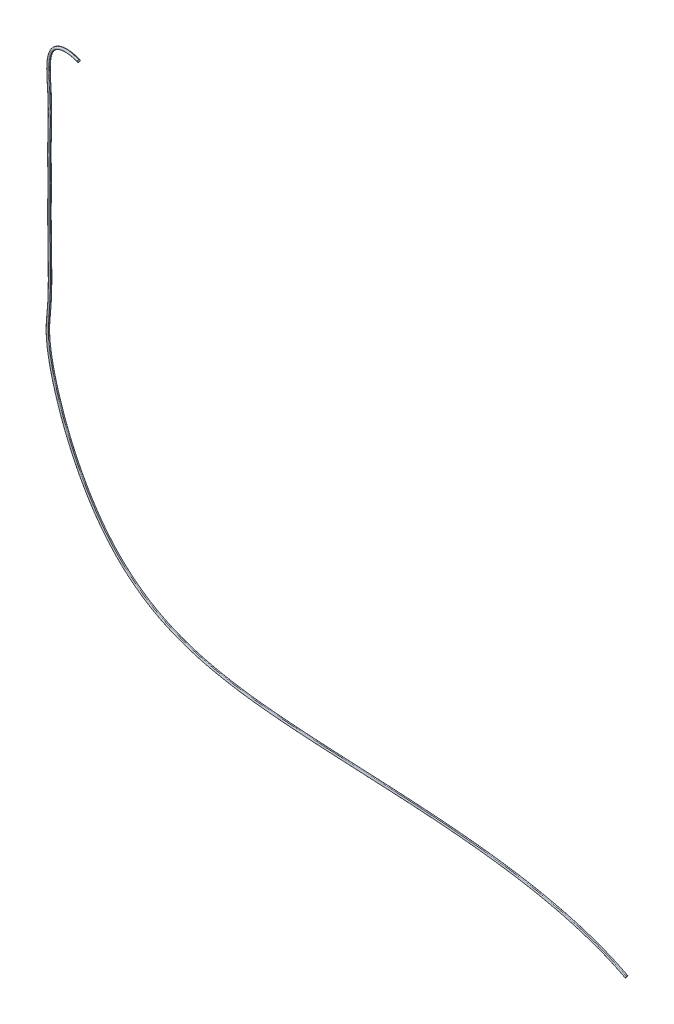
ISO-10303-21;
HEADER;
FILE_DESCRIPTION(('STEP AP214'),'2;1');
FILE_NAME('part.step','',(''),(''),'','','');
FILE_SCHEMA(('AUTOMOTIVE_DESIGN { 1 0 10303 214 1 1 1 1 }'));
ENDSEC;
DATA;
#1=APPLICATION_CONTEXT('core data for automotive mechanical design processes');
#2=APPLICATION_PROTOCOL_DEFINITION('international standard','automotive_design',2000,#1);
#3=PRODUCT_CONTEXT('',#1,'mechanical');
#4=PRODUCT('Part','Part','',(#3));
#5=PRODUCT_RELATED_PRODUCT_CATEGORY('part','',(#4));
#6=PRODUCT_DEFINITION_FORMATION('','',#4);
#7=PRODUCT_DEFINITION_CONTEXT('part definition',#1,'design');
#8=PRODUCT_DEFINITION('design','',#6,#7);
#9=PRODUCT_DEFINITION_SHAPE('','',#8);
#10=(LENGTH_UNIT() NAMED_UNIT(*) SI_UNIT(.MILLI.,.METRE.));
#11=(NAMED_UNIT(*) PLANE_ANGLE_UNIT() SI_UNIT($,.RADIAN.));
#12=(NAMED_UNIT(*) SI_UNIT($,.STERADIAN.) SOLID_ANGLE_UNIT());
#13=UNCERTAINTY_MEASURE_WITH_UNIT(LENGTH_MEASURE(1.E-05),#10,'distance_accuracy_value','');
#14=(GEOMETRIC_REPRESENTATION_CONTEXT(3) GLOBAL_UNCERTAINTY_ASSIGNED_CONTEXT((#13)) GLOBAL_UNIT_ASSIGNED_CONTEXT((#10,
#11,#12)) REPRESENTATION_CONTEXT('',''));
#15=CARTESIAN_POINT('',(0.,0.,0.));
#16=DIRECTION('',(0.,0.,1.));
#17=DIRECTION('',(1.,0.,0.));
#18=AXIS2_PLACEMENT_3D('',#15,#16,#17);
#19=CARTESIAN_POINT('',(-22.68005104515,2.224598771754,3.80305513116));
#20=CARTESIAN_POINT('',(-23.14939137977,2.27334218816,3.714687562907));
#21=CARTESIAN_POINT('',(-23.73612510197,2.258512520011,3.625875072399));
#22=CARTESIAN_POINT('',(-24.29269904815,2.036709590016,3.585241075448));
#23=CARTESIAN_POINT('',(-24.6934728354,1.642063572113,3.586840484367));
#24=CARTESIAN_POINT('',(-24.82623040238,0.803532674565,3.607831882713));
#25=CARTESIAN_POINT('',(-24.7092109809,-0.626143979658,3.592986233296));
#26=CARTESIAN_POINT('',(-24.69677301232,-2.074038040542,3.590939199145));
#27=CARTESIAN_POINT('',(-24.7399756797,-3.337813789141,3.59717232543));
#28=CARTESIAN_POINT('',(-24.72287696076,-4.47737515312,3.595492204974));
#29=CARTESIAN_POINT('',(-24.72614585388,-5.749508453577,3.59378715337));
#30=CARTESIAN_POINT('',(-24.73550897119,-7.40963613475,3.595086257423));
#31=CARTESIAN_POINT('',(-24.70248897414,-9.072153799069,3.595530145233));
#32=CARTESIAN_POINT('',(-24.69272537873,-10.29712343917,3.595347618964));
#33=CARTESIAN_POINT('',(-24.70610470099,-11.09383405472,3.595131911983));
#34=CARTESIAN_POINT('',(-24.74344853211,-11.73688838793,3.594989220726));
#35=CARTESIAN_POINT('',(-24.7985038808,-12.31832936208,3.594975186342));
#36=CARTESIAN_POINT('',(-24.84049991397,-12.91593660018,3.595083631492));
#37=CARTESIAN_POINT('',(-24.79327992147,-13.72085104324,3.595152291663));
#38=CARTESIAN_POINT('',(-24.60804254551,-14.77883854812,3.595126491561));
#39=CARTESIAN_POINT('',(-24.14560872555,-16.5244188663,3.595025938431));
#40=CARTESIAN_POINT('',(-23.12561137047,-19.20033795542,3.594965183938));
#41=CARTESIAN_POINT('',(-21.14840619477,-22.34174805652,3.595065556203));
#42=CARTESIAN_POINT('',(-18.40320213283,-24.60022804402,3.595129387952));
#43=CARTESIAN_POINT('',(-15.17321806605,-25.70784296162,3.595102209695));
#44=CARTESIAN_POINT('',(-11.71286656243,-26.20105784094,3.595060396968));
#45=CARTESIAN_POINT('',(-7.135053124169,-26.50445121977,3.595030081357));
#46=CARTESIAN_POINT('',(-2.848732678105,-26.66003490442,3.595044529593));
#47=CARTESIAN_POINT('',(1.703239265398,-27.05923259003,3.595071838688));
#48=CARTESIAN_POINT('',(5.866895686612,-27.66363313624,3.59509455135));
#49=CARTESIAN_POINT('',(8.646408634705,-28.61040465031,3.595086209381));
#50=CARTESIAN_POINT('',(9.939994491632,-29.28986294037,3.595070687589));
#51=CARTESIAN_POINT('',(-22.67594255195,2.224172083527,3.780998624961));
#52=CARTESIAN_POINT('',(-23.14567461272,2.272956182717,3.692557302365));
#53=CARTESIAN_POINT('',(-23.73316660904,2.258281920396,3.603592381906));
#54=CARTESIAN_POINT('',(-24.291385625,2.03582187288,3.562848018338));
#55=CARTESIAN_POINT('',(-24.69233038945,1.640697240673,3.564462760546));
#56=CARTESIAN_POINT('',(-24.8246999269,0.80365339853,3.585428717829));
#57=CARTESIAN_POINT('',(-24.70784867759,-0.625941703835,3.570597613238));
#58=CARTESIAN_POINT('',(-24.69529318949,-2.074193353165,3.56854500817));
#59=CARTESIAN_POINT('',(-24.73852941326,-3.337902049831,3.574781185237));
#60=CARTESIAN_POINT('',(-24.72140639733,-4.477297723891,3.573100291577));
#61=CARTESIAN_POINT('',(-24.72468246,-5.749557643154,3.571395751517));
#62=CARTESIAN_POINT('',(-24.73403697624,-7.409636241848,3.572694725487));
#63=CARTESIAN_POINT('',(-24.70101826542,-9.072129477646,3.573138754001));
#64=CARTESIAN_POINT('',(-24.69125370048,-10.2971167399,3.572956211347));
#65=CARTESIAN_POINT('',(-24.70463364163,-11.09386501431,3.572740514895));
#66=CARTESIAN_POINT('',(-24.74198153372,-11.73697844552,3.572597784721));
#67=CARTESIAN_POINT('',(-24.79704067648,-12.31845110978,3.572583794416));
#68=CARTESIAN_POINT('',(-24.83902826321,-12.91592568667,3.57269218505));
#69=CARTESIAN_POINT('',(-24.7918210379,-13.72066126996,3.572760862382));
#70=CARTESIAN_POINT('',(-24.60661079332,-14.77852224528,3.572735047095));
#71=CARTESIAN_POINT('',(-24.14421489243,-16.52396418945,3.572634520603));
#72=CARTESIAN_POINT('',(-23.12431021309,-19.19967989171,3.572573768421));
#73=CARTESIAN_POINT('',(-21.14728042566,-22.34078531488,3.572674129763));
#74=CARTESIAN_POINT('',(-18.40247804947,-24.59892731541,3.572737959055));
#75=CARTESIAN_POINT('',(-15.17287769196,-25.70642095738,3.572710779779));
#76=CARTESIAN_POINT('',(-11.71270442239,-26.19960211683,3.572668969337));
#77=CARTESIAN_POINT('',(-7.134973008623,-26.50298779752,3.572638649211));
#78=CARTESIAN_POINT('',(-2.848625550974,-26.65856939685,3.572653102518));
#79=CARTESIAN_POINT('',(1.703428674818,-27.05777409896,3.572680410383));
#80=CARTESIAN_POINT('',(5.867215471693,-27.66219101581,3.572703126822));
#81=CARTESIAN_POINT('',(8.646963645771,-28.60903025356,3.572694782415));
#82=CARTESIAN_POINT('',(9.940680097567,-29.28855713881,3.572679259056));
#83=CARTESIAN_POINT('',(-22.6699985227,2.201939898635,3.737165288818));
#84=CARTESIAN_POINT('',(-23.13894823257,2.250642746645,3.648871267533));
#85=CARTESIAN_POINT('',(-23.7252331616,2.235991145766,3.560139908746));
#86=CARTESIAN_POINT('',(-24.2772717445,2.014748377718,3.520010272037));
#87=CARTESIAN_POINT('',(-24.6681799924,1.630052222395,3.521567198009));
#88=CARTESIAN_POINT('',(-24.80008980574,0.806313520054,3.542253592045));
#89=CARTESIAN_POINT('',(-24.68351648105,-0.624422903858,3.527567022031));
#90=CARTESIAN_POINT('',(-24.67084005022,-2.074991048116,3.525441498605));
#91=CARTESIAN_POINT('',(-24.71414729517,-3.338305979496,3.53170730455));
#92=CARTESIAN_POINT('',(-24.69700503446,-4.476753881883,3.530013774323));
#93=CARTESIAN_POINT('',(-24.70029422686,-5.750063436829,3.528314410601));
#94=CARTESIAN_POINT('',(-24.70964521935,-7.409382250692,3.529609570917));
#95=CARTESIAN_POINT('',(-24.67663247779,-9.071676120304,3.530054581112));
#96=CARTESIAN_POINT('',(-24.66686235389,-10.29715089553,3.52987143712));
#97=CARTESIAN_POINT('',(-24.68024806953,-11.09468905899,3.529655763927));
#98=CARTESIAN_POINT('',(-24.71766353871,-11.7389272773,3.52951215362));
#99=CARTESIAN_POINT('',(-24.7727773093,-12.32101261361,3.529498955936));
#100=CARTESIAN_POINT('',(-24.81456025945,-12.91603045419,3.529606135918));
#101=CARTESIAN_POINT('',(-24.76758114632,-13.71742488974,3.529675157334));
#102=CARTESIAN_POINT('',(-24.58280581055,-14.77309339204,3.529648975166));
#103=CARTESIAN_POINT('',(-24.12104133475,-16.51609597402,3.529548951429));
#104=CARTESIAN_POINT('',(-23.10225080719,-19.18907488663,3.529488143628));
#105=CARTESIAN_POINT('',(-21.12812278978,-22.32487744572,3.529588275866));
#106=CARTESIAN_POINT('',(-18.39067098875,-24.57687196796,3.529652051259));
#107=CARTESIAN_POINT('',(-15.16787163455,-25.68240495317,3.529624846779));
#108=CARTESIAN_POINT('',(-11.7105026503,-26.17528874164,3.529583074806));
#109=CARTESIAN_POINT('',(-7.13417635016,-26.47859673702,3.529552665212));
#110=CARTESIAN_POINT('',(-2.847358940974,-26.63420052488,3.529567215223));
#111=CARTESIAN_POINT('',(1.706198477167,-27.0335280981,3.529594498477));
#112=CARTESIAN_POINT('',(5.872393207579,-27.63825493577,3.529617287855));
#113=CARTESIAN_POINT('',(8.655733723082,-28.58609403024,3.529608898412));
#114=CARTESIAN_POINT('',(9.952018342616,-29.26696985019,3.529593344237));
#115=CARTESIAN_POINT('',(-22.67443347108,2.12944711624,3.720733403807));
#116=CARTESIAN_POINT('',(-23.13854672187,2.177647673009,3.63334999279));
#117=CARTESIAN_POINT('',(-23.71561860722,2.16273436812,3.546334314049));
#118=CARTESIAN_POINT('',(-24.23773425398,1.949398995875,3.50886604484));
#119=CARTESIAN_POINT('',(-24.59442317545,1.601959815904,3.510163324771));
#120=CARTESIAN_POINT('',(-24.72693116694,0.81337715019,3.530086142065));
#121=CARTESIAN_POINT('',(-24.60992620653,-0.621106165608,3.515804284358));
#122=CARTESIAN_POINT('',(-24.59736073819,-2.076980332545,3.513478804432));
#123=CARTESIAN_POINT('',(-24.64063557393,-3.339300269827,3.519826992666));
#124=CARTESIAN_POINT('',(-24.6234998758,-4.475508476982,3.518099364784));
#125=CARTESIAN_POINT('',(-24.62678532656,-5.751506562915,3.516414344604));
#126=CARTESIAN_POINT('',(-24.63613942313,-7.408555588082,3.517699366022));
#127=CARTESIAN_POINT('',(-24.60313772719,-9.070302526412,3.51814724422));
#128=CARTESIAN_POINT('',(-24.59335230182,-10.2972616579,3.5179624624));
#129=CARTESIAN_POINT('',(-24.60675752003,-11.09715409832,3.517746856364));
#130=CARTESIAN_POINT('',(-24.64437265555,-11.74472717583,3.51760066613));
#131=CARTESIAN_POINT('',(-24.69965335894,-12.32858859294,3.517589839202));
#132=CARTESIAN_POINT('',(-24.7408290402,-12.91625287341,3.517693439972));
#133=CARTESIAN_POINT('',(-24.69453731794,-13.70768862179,3.517763487791));
#134=CARTESIAN_POINT('',(-24.51106995925,-14.75678004227,3.517736225124));
#135=CARTESIAN_POINT('',(-24.05121157809,-16.4924613854,3.517637704075));
#136=CARTESIAN_POINT('',(-23.03587357618,-19.15704450383,3.51757675077));
#137=CARTESIAN_POINT('',(-21.07049466063,-22.27691693934,3.517676203187));
#138=CARTESIAN_POINT('',(-18.35504369314,-24.51050592682,3.517739819317));
#139=CARTESIAN_POINT('',(-15.15264298071,-25.61011888648,3.51771254072));
#140=CARTESIAN_POINT('',(-11.70375945686,-26.10204960689,3.517670884686));
#141=CARTESIAN_POINT('',(-7.131659771669,-26.4051118228,3.517640208634));
#142=CARTESIAN_POINT('',(-2.843432065854,-26.56077089767,3.517655047392));
#143=CARTESIAN_POINT('',(1.714625563902,-26.96046710104,3.517682257394));
#144=CARTESIAN_POINT('',(5.888024657465,-27.56612016473,3.517705264371));
#145=CARTESIAN_POINT('',(8.682260287348,-28.51699943829,3.517696740203));
#146=CARTESIAN_POINT('',(9.986198666462,-29.20189540919,3.517681094191));
#147=CARTESIAN_POINT('',(-22.68898086826,2.072256436172,3.766451660007));
#148=CARTESIAN_POINT('',(-23.14820592418,2.119949328673,3.67998860009));
#149=CARTESIAN_POINT('',(-23.71563570317,2.104598724575,3.594766719266));
#150=CARTESIAN_POINT('',(-24.20953642369,1.899334211459,3.559710833983));
#151=CARTESIAN_POINT('',(-24.53844288068,1.582894735775,3.560767686982));
#152=CARTESIAN_POINT('',(-24.67240962689,0.818370461045,3.580152831552));
#153=CARTESIAN_POINT('',(-24.55448961015,-0.619161678305,3.566159861865));
#154=CARTESIAN_POINT('',(-24.54226605411,-2.078236674426,3.563692688369));
#155=CARTESIAN_POINT('',(-24.58540191145,-3.339914132611,3.570099385356));
#156=CARTESIAN_POINT('',(-24.56831191587,-4.474752044351,3.568347755364));
#157=CARTESIAN_POINT('',(-24.57157347533,-5.752545954571,3.566672910858));
#158=CARTESIAN_POINT('',(-24.58094084664,-7.407900049663,3.567950815604));
#159=CARTESIAN_POINT('',(-24.54794387334,-9.069265927427,3.56840077571));
#160=CARTESIAN_POINT('',(-24.53814785482,-10.29735509007,3.568214824171));
#161=CARTESIAN_POINT('',(-24.55156820471,-11.0990145691,3.567999263293));
#162=CARTESIAN_POINT('',(-24.58933181756,-11.74907976982,3.567851154563));
#163=CARTESIAN_POINT('',(-24.64473826227,-12.33425425741,3.567842106896));
#164=CARTESIAN_POINT('',(-24.68545793917,-12.91640106921,3.567943033847));
#165=CARTESIAN_POINT('',(-24.63968324218,-13.70037849529,3.568013851735));
#166=CARTESIAN_POINT('',(-24.45719639383,-14.74453671512,3.567985783144));
#167=CARTESIAN_POINT('',(-23.99877071363,-16.47472341125,3.567888389941));
#168=CARTESIAN_POINT('',(-22.98603788986,-19.13298083255,3.567827334076));
#169=CARTESIAN_POINT('',(-21.02723048938,-22.24089558779,3.567926278057));
#170=CARTESIAN_POINT('',(-18.32828255836,-24.46067809555,3.567989775504));
#171=CARTESIAN_POINT('',(-15.14118822294,-25.55584378229,3.567962441676));
#172=CARTESIAN_POINT('',(-11.69868166046,-26.04705172412,3.567920872961));
#173=CARTESIAN_POINT('',(-7.129755515721,-26.34992773319,3.567889997228));
#174=CARTESIAN_POINT('',(-2.84046972845,-26.50562706954,3.56790505258));
#175=CARTESIAN_POINT('',(1.720963812433,-26.90559984275,3.567932207704));
#176=CARTESIAN_POINT('',(5.899766998297,-27.51194765566,3.567955377833));
#177=CARTESIAN_POINT('',(8.702193630396,-28.46511341527,3.567946752627));
#178=CARTESIAN_POINT('',(10.011869565005,-29.15302304747,3.567931037769));
#179=CARTESIAN_POINT('',(-22.6980519238467,2.07331651479667,3.81521484547901));
#180=CARTESIAN_POINT('',(-23.15644184688,2.12092267443567,3.72890902468601));
#181=CARTESIAN_POINT('',(-23.7221107496033,2.10532468731033,3.64402418804934));
#182=CARTESIAN_POINT('',(-24.2125456866167,1.90148016893033,3.60919627243501));
#183=CARTESIAN_POINT('',(-24.54123944572,1.58590899814967,3.61022402288668));
#184=CARTESIAN_POINT('',(-24.67603613087,0.817897937045,3.62967121977668));
#185=CARTESIAN_POINT('',(-24.5576856214567,-0.619712166989667,3.61564602745501));
#186=CARTESIAN_POINT('',(-24.5456921234167,-2.07792651041733,3.61319358571501));
#187=CARTESIAN_POINT('',(-24.5887421871233,-3.33974305247367,3.61959349790334));
#188=CARTESIAN_POINT('',(-24.57169396923,-4.474946057065,3.61784427020068));
#189=CARTESIAN_POINT('',(-24.5749388308633,-5.75243968361367,3.61616825918801));
#190=CARTESIAN_POINT('',(-24.5843193175867,-7.40790622526433,3.61744678456601));
#191=CARTESIAN_POINT('',(-24.55131925616,-9.069323765175,3.61789649267001));
#192=CARTESIAN_POINT('',(-24.5415250299667,-10.2973624804167,3.61771062758434));
#193=CARTESIAN_POINT('',(-24.5549445838833,-11.0989207579933,3.61749505164101));
#194=CARTESIAN_POINT('',(-24.59269821758,-11.7488322321533,3.61734705879701));
#195=CARTESIAN_POINT('',(-24.6480968516033,-12.3339170941767,3.61733790308801));
#196=CARTESIAN_POINT('',(-24.6888415513633,-12.91639289471,3.61743898579234));
#197=CARTESIAN_POINT('',(-24.6430364912333,-13.70082259517,3.61750975879701));
#198=CARTESIAN_POINT('',(-24.46048788095,-14.7452821652667,3.61748173640601));
#199=CARTESIAN_POINT('',(-24.0019754992167,-16.47580059767,3.61738427614834));
#200=CARTESIAN_POINT('',(-22.9890721184133,-19.1344605835767,3.61732322446201));
#201=CARTESIAN_POINT('',(-21.0298631790533,-22.2430989249433,3.61742219827234));
#202=CARTESIAN_POINT('',(-18.3299248344133,-24.4637113667767,3.61748570270134));
#203=CARTESIAN_POINT('',(-15.1419060703,-25.55915043395,3.61745837203401));
#204=CARTESIAN_POINT('',(-11.6990055045267,-26.0504099494333,3.61741679803368));
#205=CARTESIAN_POINT('',(-7.12988692323767,-26.3532985700567,3.61738593410534));
#206=CARTESIAN_POINT('',(-2.84066551078533,-26.5089972129733,3.61740097657934));
#207=CARTESIAN_POINT('',(1.72056548783167,-26.9089531959433,3.61742813494201));
#208=CARTESIAN_POINT('',(5.899045284485,-27.5152597273333,3.61745129538768));
#209=CARTESIAN_POINT('',(8.70096267152267,-28.4682822023967,3.61744267623234));
#210=CARTESIAN_POINT('',(10.010299346063,-29.1560136376433,3.61742696544501));
#211=CARTESIAN_POINT('',(-22.7007437047067,2.08336592886184,3.83505474985952));
#212=CARTESIAN_POINT('',(-23.1594797642067,2.13100803655934,3.74868375836752));
#213=CARTESIAN_POINT('',(-23.72572612332,2.11536794175334,3.66369254785819));
#214=CARTESIAN_POINT('',(-24.21891429989,1.91097952200251,3.62859065727868));
#215=CARTESIAN_POINT('',(-24.55210727917,1.590737744376,3.62964315424102));
#216=CARTESIAN_POINT('',(-24.6871203828533,0.816761192957832,3.64921519061918));
#217=CARTESIAN_POINT('',(-24.5686637211817,-0.620365509741167,3.63512454841002));
#218=CARTESIAN_POINT('',(-24.55673449405,-2.07755368605583,3.63270439233852));
#219=CARTESIAN_POINT('',(-24.5997562780167,-3.33955183604917,3.63909089619885));
#220=CARTESIAN_POINT('',(-24.5827206406783,-4.475184821034,3.63734717907918));
#221=CARTESIAN_POINT('',(-24.58595984249,-5.7522094526915,3.63566883441035));
#222=CARTESIAN_POINT('',(-24.5953438298133,-7.40801933835917,3.63694898481885));
#223=CARTESIAN_POINT('',(-24.5623411197933,-9.06952808723883,3.63739823016752));
#224=CARTESIAN_POINT('',(-24.5525495199133,-10.2973495068933,3.63721262205468));
#225=CARTESIAN_POINT('',(-24.56596625464,-11.09855552333,3.63699703308502));
#226=CARTESIAN_POINT('',(-24.60368956637,-11.7479645530817,3.63684942982135));
#227=CARTESIAN_POINT('',(-24.65906321561,-12.3327781382117,3.63683991830485));
#228=CARTESIAN_POINT('',(-24.699898590945,-12.9163564029983,3.63694153871285));
#229=CARTESIAN_POINT('',(-24.6539907616567,-13.7022826033383,3.63701215797402));
#230=CARTESIAN_POINT('',(-24.471245435585,-14.7477295407317,3.63698429794402));
#231=CARTESIAN_POINT('',(-24.0124475459067,-16.4793459282917,3.63688661243152));
#232=CARTESIAN_POINT('',(-22.9990269356117,-19.1392637067667,3.63682558313335));
#233=CARTESIAN_POINT('',(-21.0385061331,-22.2502909539017,3.63692465901835));
#234=CARTESIAN_POINT('',(-18.3352676880983,-24.473664344625,3.63698818741452));
#235=CARTESIAN_POINT('',(-15.1441892127067,-25.56999118922,3.63696086788985));
#236=CARTESIAN_POINT('',(-11.700016294315,-26.0613934688817,3.63691927653535));
#237=CARTESIAN_POINT('',(-7.1302639829865,-26.36431884133,3.63688845258035));
#238=CARTESIAN_POINT('',(-2.84125420285783,-26.5200092273567,3.63690345175452));
#239=CARTESIAN_POINT('',(1.719301822364,-26.919909898635,3.63693062110735));
#240=CARTESIAN_POINT('',(5.89670111063467,-27.52607755229,3.63695374891568));
#241=CARTESIAN_POINT('',(8.6969849224545,-28.47864418169,3.63694514996935));
#242=CARTESIAN_POINT('',(10.0051736408587,-29.16577265092,3.63692945295652));
#243=B_SPLINE_SURFACE_WITH_KNOTS('',3,3,((#19,#20,#21,#22,#23,#24,#25,#26,#27,#28,#29,#30,#31,
#32,#33,#34,#35,#36,#37,#38,#39,#40,#41,#42,#43,#44,#45,#46,#47,#48,#49,#50),(#51,#52,#53,#54,
#55,#56,#57,#58,#59,#60,#61,#62,#63,#64,#65,#66,#67,#68,#69,#70,#71,#72,#73,#74,#75,#76,#77,#78,
#79,#80,#81,#82),(#83,#84,#85,#86,#87,#88,#89,#90,#91,#92,#93,#94,#95,#96,#97,#98,#99,#100,#101,
#102,#103,#104,#105,#106,#107,#108,#109,#110,#111,#112,#113,#114),(#115,#116,#117,#118,#119,
#120,#121,#122,#123,#124,#125,#126,#127,#128,#129,#130,#131,#132,#133,#134,#135,#136,#137,#138,
#139,#140,#141,#142,#143,#144,#145,#146),(#147,#148,#149,#150,#151,#152,#153,#154,#155,#156,
#157,#158,#159,#160,#161,#162,#163,#164,#165,#166,#167,#168,#169,#170,#171,#172,#173,#174,#175,
#176,#177,#178),(#179,#180,#181,#182,#183,#184,#185,#186,#187,#188,#189,#190,#191,#192,#193,
#194,#195,#196,#197,#198,#199,#200,#201,#202,#203,#204,#205,#206,#207,#208,#209,#210),(#211,
#212,#213,#214,#215,#216,#217,#218,#219,#220,#221,#222,#223,#224,#225,#226,#227,#228,#229,#230,
#231,#232,#233,#234,#235,#236,#237,#238,#239,#240,#241,#242)),.UNSPECIFIED.,.F.,.F.,.F.,(4,1,1,
1,4),(4,1,1,1,1,1,1,1,1,1,1,1,1,1,1,1,1,1,1,1,1,1,1,1,1,1,1,1,1,4),(-3.14159265359,
-2.243994752564,-1.346396851538,-0.448798950513,0.448798950513),(0.,0.03571428571429,
0.05357142857143,0.07142857142857,0.107142857143,0.142857142857,0.178571428571,0.214285714286,
0.25,0.285714285714,0.321428571429,0.357142857143,0.375,0.392857142857,0.410714285714,
0.428571428571,0.452380952381,0.47619047619,0.5,0.52380952381,0.571428571429,0.619047619048,
0.666666666667,0.714285714286,0.75,0.785714285714,0.857142857143,0.875,0.928571428571,1.),.UNSPECIFIED.);
#244=CARTESIAN_POINT('',(-22.68005104515,2.224598771754,3.80305513116));
#245=CARTESIAN_POINT('',(-23.14939137977,2.27334218816,3.714687562907));
#246=CARTESIAN_POINT('',(-23.73612510197,2.258512520011,3.625875072399));
#247=CARTESIAN_POINT('',(-24.29269904815,2.036709590016,3.585241075448));
#248=CARTESIAN_POINT('',(-24.6934728354,1.642063572113,3.586840484367));
#249=CARTESIAN_POINT('',(-24.82623040238,0.803532674565,3.607831882713));
#250=CARTESIAN_POINT('',(-24.7092109809,-0.626143979658,3.592986233296));
#251=CARTESIAN_POINT('',(-24.69677301232,-2.074038040542,3.590939199145));
#252=CARTESIAN_POINT('',(-24.7399756797,-3.337813789141,3.59717232543));
#253=CARTESIAN_POINT('',(-24.72287696076,-4.47737515312,3.595492204974));
#254=CARTESIAN_POINT('',(-24.72614585388,-5.749508453577,3.59378715337));
#255=CARTESIAN_POINT('',(-24.73550897119,-7.40963613475,3.595086257423));
#256=CARTESIAN_POINT('',(-24.70248897414,-9.072153799069,3.595530145233));
#257=CARTESIAN_POINT('',(-24.69272537873,-10.29712343917,3.595347618964));
#258=CARTESIAN_POINT('',(-24.70610470099,-11.09383405472,3.595131911983));
#259=CARTESIAN_POINT('',(-24.74344853211,-11.73688838793,3.594989220726));
#260=CARTESIAN_POINT('',(-24.7985038808,-12.31832936208,3.594975186342));
#261=CARTESIAN_POINT('',(-24.84049991397,-12.91593660018,3.595083631492));
#262=CARTESIAN_POINT('',(-24.79327992147,-13.72085104324,3.595152291663));
#263=CARTESIAN_POINT('',(-24.60804254551,-14.77883854812,3.595126491561));
#264=CARTESIAN_POINT('',(-24.14560872555,-16.5244188663,3.595025938431));
#265=CARTESIAN_POINT('',(-23.12561137047,-19.20033795542,3.594965183938));
#266=CARTESIAN_POINT('',(-21.14840619477,-22.34174805652,3.595065556203));
#267=CARTESIAN_POINT('',(-18.40320213283,-24.60022804402,3.595129387952));
#268=CARTESIAN_POINT('',(-15.17321806605,-25.70784296162,3.595102209695));
#269=CARTESIAN_POINT('',(-11.71286656243,-26.20105784094,3.595060396968));
#270=CARTESIAN_POINT('',(-7.135053124169,-26.50445121977,3.595030081357));
#271=CARTESIAN_POINT('',(-2.848732678105,-26.66003490442,3.595044529593));
#272=CARTESIAN_POINT('',(1.703239265398,-27.05923259003,3.595071838688));
#273=CARTESIAN_POINT('',(5.866895686612,-27.66363313624,3.59509455135));
#274=CARTESIAN_POINT('',(8.646408634705,-28.61040465031,3.595086209381));
#275=CARTESIAN_POINT('',(9.939994491632,-29.28986294037,3.595070687589));
#276=B_SPLINE_CURVE_WITH_KNOTS('',3,(#244,#245,#246,#247,#248,#249,#250,#251,#252,#253,#254,
#255,#256,#257,#258,#259,#260,#261,#262,#263,#264,#265,#266,#267,#268,#269,#270,#271,#272,#273,
#274,#275),.UNSPECIFIED.,.F.,.F.,(4,1,1,1,1,1,1,1,1,1,1,1,1,1,1,1,1,1,1,1,1,1,1,1,1,1,1,1,1,4),
(0.,0.03571428571429,0.05357142857143,0.07142857142857,0.107142857143,0.142857142857,
0.178571428571,0.214285714286,0.25,0.285714285714,0.321428571429,0.357142857143,0.375,
0.392857142857,0.410714285714,0.428571428571,0.452380952381,0.47619047619,0.5,0.52380952381,
0.571428571429,0.619047619048,0.666666666667,0.714285714286,0.75,0.785714285714,0.857142857143,
0.875,0.928571428571,1.),.UNSPECIFIED.);
#277=CARTESIAN_POINT('',(-22.680051045149,2.2245987717539,3.80305513116018));
#278=VERTEX_POINT('',#277);
#279=CARTESIAN_POINT('',(9.93999449163114,-29.2898629403695,3.595070687589));
#280=VERTEX_POINT('',#279);
#281=EDGE_CURVE('E11',#278,#280,#276,.T.);
#282=CARTESIAN_POINT('',(-22.6800510451515,2.22459877175415,3.80305513115972));
#283=CARTESIAN_POINT('',(-22.6785055019685,2.22443594500692,3.7947565833814));
#284=CARTESIAN_POINT('',(-22.6771135789404,2.22275381421484,3.78643590151985));
#285=CARTESIAN_POINT('',(-22.6747781511014,2.21680220480745,3.77074901219451));
#286=CARTESIAN_POINT('',(-22.6738338394324,2.21253741352294,3.76338110484752));
#287=CARTESIAN_POINT('',(-22.6728185194482,2.20444526363764,3.75352489104419));
#288=CARTESIAN_POINT('',(-22.6725459815913,2.20139948752892,3.75039733482308));
#289=CARTESIAN_POINT('',(-22.6721677966124,2.19478694017454,3.74474123696308));
#290=CARTESIAN_POINT('',(-22.6720620425471,2.19122050438523,3.74221231236089));
#291=CARTESIAN_POINT('',(-22.6719936448893,2.1804650672187,3.73591635391382));
#292=CARTESIAN_POINT('',(-22.6722319513619,2.17279576579025,3.7329516790369));
#293=CARTESIAN_POINT('',(-22.6732479024559,2.15646447646114,3.72933931292796));
#294=CARTESIAN_POINT('',(-22.6740568785611,2.14777056192816,3.72884041967413));
#295=CARTESIAN_POINT('',(-22.6756581581416,2.13507740956783,3.7303436576906));
#296=CARTESIAN_POINT('',(-22.676256478132,2.13090469453827,3.73121980855766));
#297=CARTESIAN_POINT('',(-22.6775658869128,2.12280121427738,3.73370451020736));
#298=CARTESIAN_POINT('',(-22.6782770432813,2.11887059600931,3.73531350097692));
#299=CARTESIAN_POINT('',(-22.6804528156686,2.10800319569899,3.74087508342513));
#300=CARTESIAN_POINT('',(-22.6820263787217,2.10149130986805,3.74564068983072));
#301=CARTESIAN_POINT('',(-22.6854495769856,2.08986494501741,3.75740899235891));
#302=CARTESIAN_POINT('',(-22.6873111337715,2.0848962294251,3.76455540957192));
#303=CARTESIAN_POINT('',(-22.6908754870559,2.07816731657393,3.7797748457165));
#304=CARTESIAN_POINT('',(-22.6925814748341,2.07625145239461,3.78777894862472));
#305=CARTESIAN_POINT('',(-22.6957703895075,2.07505295671572,3.80405491428478));
#306=CARTESIAN_POINT('',(-22.6972522083287,2.07578298756483,3.8123278763345));
#307=CARTESIAN_POINT('',(-22.6992141508817,2.07889548205739,3.82446504852983));
#308=CARTESIAN_POINT('',(-22.6998364542475,2.08033245243689,3.82856287451218));
#309=CARTESIAN_POINT('',(-22.700945004314,2.08394058249728,3.83644087612876));
#310=CARTESIAN_POINT('',(-22.7014313219981,2.08611135782567,3.84022121676406));
#311=CARTESIAN_POINT('',(-22.7026168304014,2.09324256705171,3.8504512867741));
#312=CARTESIAN_POINT('',(-22.7031363855628,2.098991987511,3.85638213448908));
#313=CARTESIAN_POINT('',(-22.7036583216266,2.11241470081493,3.86655820437992));
#314=CARTESIAN_POINT('',(-22.7036287481452,2.12018069448183,3.87068484315692));
#315=CARTESIAN_POINT('',(-22.7031001040872,2.13244445188053,3.87464176381569));
#316=CARTESIAN_POINT('',(-22.702846025995,2.13660889756283,3.87558939897365));
#317=CARTESIAN_POINT('',(-22.7021867662363,2.1450290147738,3.87673244370512));
#318=CARTESIAN_POINT('',(-22.701781477753,2.14928474878187,3.87692732041341));
#319=CARTESIAN_POINT('',(-22.7004254739421,2.16152395734154,3.87647640333336));
#320=CARTESIAN_POINT('',(-22.6993097601739,2.16946727194362,3.87493211300221));
#321=CARTESIAN_POINT('',(-22.6966206821946,2.18509330376483,3.86926910119654));
#322=CARTESIAN_POINT('',(-22.6950169730632,2.19269940236281,3.86494694820542));
#323=CARTESIAN_POINT('',(-22.6916545297874,2.20544264942282,3.85411739984613));
#324=CARTESIAN_POINT('',(-22.6899067956436,2.21068001364716,3.84772370685469));
#325=CARTESIAN_POINT('',(-22.6863911690453,2.21885159048065,3.83355884054116));
#326=CARTESIAN_POINT('',(-22.6846232187606,2.22177137297044,3.82577940043739));
#327=CARTESIAN_POINT('',(-22.6819417519152,2.22425596456174,3.81290801462449));
#328=CARTESIAN_POINT('',(-22.680969286057,2.22469551067512,3.80798547934442));
#329=CARTESIAN_POINT('',(-22.6800510451515,2.22459877175415,3.80305513115972));
#330=B_SPLINE_CURVE_WITH_KNOTS('',3,(#282,#283,#284,#285,#286,#287,#288,#289,#290,#291,#292,
#293,#294,#295,#296,#297,#298,#299,#300,#301,#302,#303,#304,#305,#306,#307,#308,#309,#310,#311,
#312,#313,#314,#315,#316,#317,#318,#319,#320,#321,#322,#323,#324,#325,#326,#327,#328,#329),
.UNSPECIFIED.,.T.,.F.,(4,2,2,2,2,2,2,2,2,2,2,2,2,2,2,2,2,2,2,2,2,2,2,4),(0.,0.0252764102842538,
0.0505070827372219,0.0635655082244795,0.0766155571158931,0.100874965314454,0.126581821700635,
0.139432791606494,0.152291487248041,0.176552197672792,0.202676473856283,0.227420325844173,
0.252282749467302,0.265379267976817,0.27846893739106,0.302878997838578,0.328713736993377,
0.341483594906995,0.354262490736612,0.378370868847535,0.404484323279451,0.429355864666813,
0.454381076623351,0.469398343124613),.UNSPECIFIED.);
#331=CARTESIAN_POINT('',(-22.7007437047077,2.08336592886195,3.83505474985932));
#332=VERTEX_POINT('',#331);
#333=EDGE_CURVE('E47',#278,#332,#330,.T.);
#334=CARTESIAN_POINT('',(-22.7007437047067,2.08336592886184,3.83505474985952));
#335=CARTESIAN_POINT('',(-23.1594797642067,2.13100803655934,3.74868375836752));
#336=CARTESIAN_POINT('',(-23.72572612332,2.11536794175334,3.66369254785819));
#337=CARTESIAN_POINT('',(-24.21891429989,1.91097952200251,3.62859065727868));
#338=CARTESIAN_POINT('',(-24.55210727917,1.590737744376,3.62964315424102));
#339=CARTESIAN_POINT('',(-24.6871203828533,0.816761192957832,3.64921519061918));
#340=CARTESIAN_POINT('',(-24.5686637211817,-0.620365509741167,3.63512454841002));
#341=CARTESIAN_POINT('',(-24.55673449405,-2.07755368605583,3.63270439233852));
#342=CARTESIAN_POINT('',(-24.5997562780167,-3.33955183604917,3.63909089619885));
#343=CARTESIAN_POINT('',(-24.5827206406783,-4.475184821034,3.63734717907918));
#344=CARTESIAN_POINT('',(-24.58595984249,-5.7522094526915,3.63566883441035));
#345=CARTESIAN_POINT('',(-24.5953438298133,-7.40801933835917,3.63694898481885));
#346=CARTESIAN_POINT('',(-24.5623411197933,-9.06952808723883,3.63739823016752));
#347=CARTESIAN_POINT('',(-24.5525495199133,-10.2973495068933,3.63721262205468));
#348=CARTESIAN_POINT('',(-24.56596625464,-11.09855552333,3.63699703308502));
#349=CARTESIAN_POINT('',(-24.60368956637,-11.7479645530817,3.63684942982135));
#350=CARTESIAN_POINT('',(-24.65906321561,-12.3327781382117,3.63683991830485));
#351=CARTESIAN_POINT('',(-24.699898590945,-12.9163564029983,3.63694153871285));
#352=CARTESIAN_POINT('',(-24.6539907616567,-13.7022826033383,3.63701215797402));
#353=CARTESIAN_POINT('',(-24.471245435585,-14.7477295407317,3.63698429794402));
#354=CARTESIAN_POINT('',(-24.0124475459067,-16.4793459282917,3.63688661243152));
#355=CARTESIAN_POINT('',(-22.9990269356117,-19.1392637067667,3.63682558313335));
#356=CARTESIAN_POINT('',(-21.0385061331,-22.2502909539017,3.63692465901835));
#357=CARTESIAN_POINT('',(-18.3352676880983,-24.473664344625,3.63698818741452));
#358=CARTESIAN_POINT('',(-15.1441892127067,-25.56999118922,3.63696086788985));
#359=CARTESIAN_POINT('',(-11.700016294315,-26.0613934688817,3.63691927653535));
#360=CARTESIAN_POINT('',(-7.1302639829865,-26.36431884133,3.63688845258035));
#361=CARTESIAN_POINT('',(-2.84125420285783,-26.5200092273567,3.63690345175452));
#362=CARTESIAN_POINT('',(1.719301822364,-26.919909898635,3.63693062110735));
#363=CARTESIAN_POINT('',(5.89670111063467,-27.52607755229,3.63695374891568));
#364=CARTESIAN_POINT('',(8.6969849224545,-28.47864418169,3.63694514996935));
#365=CARTESIAN_POINT('',(10.0051736408587,-29.16577265092,3.63692945295652));
#366=B_SPLINE_CURVE_WITH_KNOTS('',3,(#334,#335,#336,#337,#338,#339,#340,#341,#342,#343,#344,
#345,#346,#347,#348,#349,#350,#351,#352,#353,#354,#355,#356,#357,#358,#359,#360,#361,#362,#363,
#364,#365),.UNSPECIFIED.,.F.,.F.,(4,1,1,1,1,1,1,1,1,1,1,1,1,1,1,1,1,1,1,1,1,1,1,1,1,1,1,1,1,4),
(0.,0.03571428571429,0.05357142857143,0.07142857142857,0.107142857143,0.142857142857,
0.178571428571,0.214285714286,0.25,0.285714285714,0.321428571429,0.357142857143,0.375,
0.392857142857,0.410714285714,0.428571428571,0.452380952381,0.47619047619,0.5,0.52380952381,
0.571428571429,0.619047619048,0.666666666667,0.714285714286,0.75,0.785714285714,0.857142857143,
0.875,0.928571428571,1.),.UNSPECIFIED.);
#367=CARTESIAN_POINT('',(10.00517364086,-29.1657726509207,3.63692945295652));
#368=VERTEX_POINT('',#367);
#369=EDGE_CURVE('E29',#332,#368,#366,.T.);
#370=CARTESIAN_POINT('',(9.93999449163329,-29.2898629403707,3.595070687589));
#371=CARTESIAN_POINT('',(9.939737852528,-29.2903517347112,3.6034878589386));
#372=CARTESIAN_POINT('',(9.94018791121149,-29.2894950861076,3.61202776705085));
#373=CARTESIAN_POINT('',(9.94233308116306,-29.2854113788277,3.62831098601483));
#374=CARTESIAN_POINT('',(9.94402594569516,-29.2821885976293,3.63605570564201));
#375=CARTESIAN_POINT('',(9.9474020546941,-29.2757612368681,3.64657664299353));
#376=CARTESIAN_POINT('',(9.94869620875154,-29.2732974402124,3.64994772557423));
#377=CARTESIAN_POINT('',(9.95155053555764,-29.2678633745227,3.65612006707595));
#378=CARTESIAN_POINT('',(9.95311054510087,-29.2648934162149,3.65892167329152));
#379=CARTESIAN_POINT('',(9.95787892551786,-29.2558153035405,3.66604389471452));
#380=CARTESIAN_POINT('',(9.96134522633299,-29.2492160716382,3.66958011675184));
#381=CARTESIAN_POINT('',(9.96883969907229,-29.2349478378535,3.67436116482816));
#382=CARTESIAN_POINT('',(9.97288908901686,-29.2272384366438,3.67545606559677));
#383=CARTESIAN_POINT('',(9.97887860444321,-29.2158352889649,3.67476199733809));
#384=CARTESIAN_POINT('',(9.98085523923675,-29.2120720611009,3.67414652121525));
#385=CARTESIAN_POINT('',(9.98472409960333,-29.2047062903854,3.67215430241489));
#386=CARTESIAN_POINT('',(9.98661627531975,-29.2011038424434,3.67077711635435));
#387=CARTESIAN_POINT('',(9.9918706845234,-29.1911001293608,3.66585771433161));
#388=CARTESIAN_POINT('',(9.99506823850934,-29.1850123699049,3.66147581084794));
#389=CARTESIAN_POINT('',(10.0009308046245,-29.1738506765412,3.65036412634587));
#390=CARTESIAN_POINT('',(10.0035295505453,-29.1689028997123,3.64346960161586));
#391=CARTESIAN_POINT('',(10.0073154658316,-29.1616947465322,3.62846076820463));
#392=CARTESIAN_POINT('',(10.0085571595647,-29.1593305654707,3.62040958480054));
#393=CARTESIAN_POINT('',(10.0098046982351,-29.1569550621132,3.60384780342609));
#394=CARTESIAN_POINT('',(10.0098055133768,-29.1569533157478,3.59533547554454));
#395=CARTESIAN_POINT('',(10.0088331063007,-29.1588043446235,3.58276446717192));
#396=CARTESIAN_POINT('',(10.0083261534455,-29.1597694093681,3.57852515787661));
#397=CARTESIAN_POINT('',(10.0069541093829,-29.1623813864781,3.57032420662168));
#398=CARTESIAN_POINT('',(10.0060892216113,-29.164027911529,3.56636240842905));
#399=CARTESIAN_POINT('',(10.0031782823012,-29.1695696546998,3.55563013708789));
#400=CARTESIAN_POINT('',(10.0007525912838,-29.1741876596748,3.54932744282593));
#401=CARTESIAN_POINT('',(9.99493807936472,-29.1852573576551,3.53822541543835));
#402=CARTESIAN_POINT('',(9.99149631168486,-29.1918098562109,3.53355256452086));
#403=CARTESIAN_POINT('',(9.98594341812043,-29.2023816152905,3.52870580823462));
#404=CARTESIAN_POINT('',(9.98402854532088,-29.2060272149174,3.52745073733521));
#405=CARTESIAN_POINT('',(9.98012465737634,-29.213459587376,3.52570156745189));
#406=CARTESIAN_POINT('',(9.97813559379437,-29.2172464524361,3.52520797484694));
#407=CARTESIAN_POINT('',(9.97237061770094,-29.2282220865337,3.52482360111487));
#408=CARTESIAN_POINT('',(9.9685758159477,-29.2354468389362,3.52585680070238));
#409=CARTESIAN_POINT('',(9.96103541005768,-29.2498027395785,3.53057848969984));
#410=CARTESIAN_POINT('',(9.95731519997465,-29.2568855458291,3.53446175796702));
#411=CARTESIAN_POINT('',(9.95095622111845,-29.2689923115729,3.54459182092117));
#412=CARTESIAN_POINT('',(9.94827167247413,-29.2741034260078,3.5507067822237));
#413=CARTESIAN_POINT('',(9.94390511734571,-29.2824170016892,3.56449120375817));
#414=CARTESIAN_POINT('',(9.94223269597755,-29.2856012146433,3.57217463203165));
#415=CARTESIAN_POINT('',(9.94055262265968,-29.2888001147371,3.58506641415876));
#416=CARTESIAN_POINT('',(9.94014767311928,-29.2895711912105,3.59004668778302));
#417=CARTESIAN_POINT('',(9.93999449163329,-29.2898629403707,3.595070687589));
#418=B_SPLINE_CURVE_WITH_KNOTS('',3,(#370,#371,#372,#373,#374,#375,#376,#377,#378,#379,#380,
#381,#382,#383,#384,#385,#386,#387,#388,#389,#390,#391,#392,#393,#394,#395,#396,#397,#398,#399,
#400,#401,#402,#403,#404,#405,#406,#407,#408,#409,#410,#411,#412,#413,#414,#415,#416,#417),
.UNSPECIFIED.,.T.,.F.,(4,2,2,2,2,2,2,2,2,2,2,2,2,2,2,2,2,2,2,2,2,2,2,4),(0.,0.025253393309733,
0.0504612457751707,0.0635121681621072,0.0765551074196597,0.100888431755369,0.126679166719608,
0.139498230617458,0.152324764217311,0.176390398486742,0.202454324151093,0.227427444166677,
0.252501790325072,0.265568294379743,0.278627382135959,0.302762547365718,0.328488626402567,
0.341337882698277,0.354195680002843,0.378466547877286,0.404571750025082,0.429334306809921,
0.454327844392016,0.46940096549399),.UNSPECIFIED.);
#419=EDGE_CURVE('E48',#368,#280,#418,.T.);
#420=ORIENTED_EDGE('',*,*,#281,.F.);
#421=ORIENTED_EDGE('',*,*,#333,.T.);
#422=ORIENTED_EDGE('',*,*,#369,.T.);
#423=ORIENTED_EDGE('',*,*,#419,.T.);
#424=EDGE_LOOP('',(#420,#421,#422,#423));
#425=FACE_BOUND('',#424,.T.);
#426=ADVANCED_FACE('F17',(#425),#243,.T.);
#427=CARTESIAN_POINT('',(-22.68779851266,2.15,3.80305513116));
#428=DIRECTION('',(-0.977654259803972,0.101534441368997,-0.184073098259995));
#429=DIRECTION('',(-0.185029325256909,0.,0.982732999748646));
#430=AXIS2_PLACEMENT_3D('',#427,#428,#429);
#431=PLANE('',#430);
#432=ORIENTED_EDGE('',*,*,#333,.F.);
#433=EDGE_CURVE('E50',#332,#278,#330,.T.);
#434=ORIENTED_EDGE('',*,*,#433,.F.);
#435=EDGE_LOOP('',(#432,#434));
#436=FACE_BOUND('',#435,.T.);
#437=ADVANCED_FACE('F54',(#436),#431,.F.);
#438=CARTESIAN_POINT('',(9.974794778769,-29.22360856772,3.6));
#439=DIRECTION('',(0.885306142636974,-0.465008638302986,-1.06228261977891E-05));
#440=DIRECTION('',(0.465008638329223,0.885306142686925,0.));
#441=AXIS2_PLACEMENT_3D('',#438,#439,#440);
#442=PLANE('',#441);
#443=EDGE_CURVE('E56',#280,#368,#418,.T.);
#444=ORIENTED_EDGE('',*,*,#443,.F.);
#445=ORIENTED_EDGE('',*,*,#419,.F.);
#446=EDGE_LOOP('',(#444,#445));
#447=FACE_BOUND('',#446,.T.);
#448=ADVANCED_FACE('F84',(#447),#442,.T.);
#449=CARTESIAN_POINT('',(-22.7007437047067,2.08336592886184,3.83505474985952));
#450=CARTESIAN_POINT('',(-23.1594797642067,2.13100803655934,3.74868375836752));
#451=CARTESIAN_POINT('',(-23.72572612332,2.11536794175334,3.66369254785819));
#452=CARTESIAN_POINT('',(-24.21891429989,1.91097952200251,3.62859065727868));
#453=CARTESIAN_POINT('',(-24.55210727917,1.590737744376,3.62964315424102));
#454=CARTESIAN_POINT('',(-24.6871203828533,0.816761192957832,3.64921519061918));
#455=CARTESIAN_POINT('',(-24.5686637211817,-0.620365509741167,3.63512454841002));
#456=CARTESIAN_POINT('',(-24.55673449405,-2.07755368605583,3.63270439233852));
#457=CARTESIAN_POINT('',(-24.5997562780167,-3.33955183604917,3.63909089619885));
#458=CARTESIAN_POINT('',(-24.5827206406783,-4.475184821034,3.63734717907918));
#459=CARTESIAN_POINT('',(-24.58595984249,-5.7522094526915,3.63566883441035));
#460=CARTESIAN_POINT('',(-24.5953438298133,-7.40801933835917,3.63694898481885));
#461=CARTESIAN_POINT('',(-24.5623411197933,-9.06952808723883,3.63739823016752));
#462=CARTESIAN_POINT('',(-24.5525495199133,-10.2973495068933,3.63721262205468));
#463=CARTESIAN_POINT('',(-24.56596625464,-11.09855552333,3.63699703308502));
#464=CARTESIAN_POINT('',(-24.60368956637,-11.7479645530817,3.63684942982135));
#465=CARTESIAN_POINT('',(-24.65906321561,-12.3327781382117,3.63683991830485));
#466=CARTESIAN_POINT('',(-24.699898590945,-12.9163564029983,3.63694153871285));
#467=CARTESIAN_POINT('',(-24.6539907616567,-13.7022826033383,3.63701215797402));
#468=CARTESIAN_POINT('',(-24.471245435585,-14.7477295407317,3.63698429794402));
#469=CARTESIAN_POINT('',(-24.0124475459067,-16.4793459282917,3.63688661243152));
#470=CARTESIAN_POINT('',(-22.9990269356117,-19.1392637067667,3.63682558313335));
#471=CARTESIAN_POINT('',(-21.0385061331,-22.2502909539017,3.63692465901835));
#472=CARTESIAN_POINT('',(-18.3352676880983,-24.473664344625,3.63698818741452));
#473=CARTESIAN_POINT('',(-15.1441892127067,-25.56999118922,3.63696086788985));
#474=CARTESIAN_POINT('',(-11.700016294315,-26.0613934688817,3.63691927653535));
#475=CARTESIAN_POINT('',(-7.1302639829865,-26.36431884133,3.63688845258035));
#476=CARTESIAN_POINT('',(-2.84125420285783,-26.5200092273567,3.63690345175452));
#477=CARTESIAN_POINT('',(1.719301822364,-26.919909898635,3.63693062110735));
#478=CARTESIAN_POINT('',(5.89670111063467,-27.52607755229,3.63695374891568));
#479=CARTESIAN_POINT('',(8.6969849224545,-28.47864418169,3.63694514996935));
#480=CARTESIAN_POINT('',(10.0051736408587,-29.16577265092,3.63692945295652));
#481=CARTESIAN_POINT('',(-22.7034354855667,2.09341534292701,3.85489465424001));
#482=CARTESIAN_POINT('',(-23.1625176815333,2.14109339868301,3.76845849204901));
#483=CARTESIAN_POINT('',(-23.7293414970367,2.12541119619634,3.68336090766701));
#484=CARTESIAN_POINT('',(-24.2252829131633,1.92047887507467,3.64798504212234));
#485=CARTESIAN_POINT('',(-24.56297511262,1.59556649060234,3.64906228559534));
#486=CARTESIAN_POINT('',(-24.6982046348367,0.815624448870666,3.66875916146167));
#487=CARTESIAN_POINT('',(-24.5796418209067,-0.621018852492667,3.65460306936501));
#488=CARTESIAN_POINT('',(-24.5677768646833,-2.07718086169433,3.65221519896201));
#489=CARTESIAN_POINT('',(-24.61077036891,-3.33936061962467,3.65858829449434));
#490=CARTESIAN_POINT('',(-24.5937473121267,-4.475423585003,3.65685008795767));
#491=CARTESIAN_POINT('',(-24.5969808541167,-5.75197922176933,3.65516940963267));
#492=CARTESIAN_POINT('',(-24.60636834204,-7.408132451454,3.65645118507167));
#493=CARTESIAN_POINT('',(-24.5733629834267,-9.06973240930267,3.65689996766501));
#494=CARTESIAN_POINT('',(-24.56357400986,-10.29733653337,3.65671461652501));
#495=CARTESIAN_POINT('',(-24.5769879253967,-11.0981902886667,3.65649901452901));
#496=CARTESIAN_POINT('',(-24.61468091516,-11.74709687401,3.65635180084567));
#497=CARTESIAN_POINT('',(-24.6700295796167,-12.3316391822467,3.65634193352167));
#498=CARTESIAN_POINT('',(-24.7109556305267,-12.9163199112867,3.65644409163334));
#499=CARTESIAN_POINT('',(-24.66494503208,-13.7037426115067,3.65651455715101));
#500=CARTESIAN_POINT('',(-24.48200299022,-14.7501769161967,3.65648685948201));
#501=CARTESIAN_POINT('',(-24.0229195925967,-16.4828912589133,3.65638894871467));
#502=CARTESIAN_POINT('',(-23.00898175281,-19.1440668299567,3.65632794180467));
#503=CARTESIAN_POINT('',(-21.0471490871467,-22.25748298286,3.65642711976434));
#504=CARTESIAN_POINT('',(-18.3406105417833,-24.4836173224733,3.65649067212767));
#505=CARTESIAN_POINT('',(-15.1464723551133,-25.58083194449,3.65646336374567));
#506=CARTESIAN_POINT('',(-11.7010270841033,-26.07237698833,3.65642175503701));
#507=CARTESIAN_POINT('',(-7.13064104273533,-26.3753391126033,3.65639097105534));
#508=CARTESIAN_POINT('',(-2.84184289493033,-26.53102124174,3.65640592692967));
#509=CARTESIAN_POINT('',(1.71803815689633,-26.9308666013267,3.65643310727267));
#510=CARTESIAN_POINT('',(5.89435693678433,-27.5368953772467,3.65645620244367));
#511=CARTESIAN_POINT('',(8.69300717338633,-28.4890061609833,3.65644762370634));
#512=CARTESIAN_POINT('',(10.0000479356543,-29.1755316641967,3.65643194046801));
#513=CARTESIAN_POINT('',(-22.70513155342,2.132552920563,3.88549108629));
#514=CARTESIAN_POINT('',(-23.16643342814,2.180461501415,3.798637002179));
#515=CARTESIAN_POINT('',(-23.73732794547,2.164858251233,3.712776878119));
#516=CARTESIAN_POINT('',(-24.24774810333,1.956330329892,3.676077143045));
#517=CARTESIAN_POINT('',(-24.60364988138,1.611867213133,3.677282475108));
#518=CARTESIAN_POINT('',(-24.73891513879,0.811549996522,3.697416656607));
#519=CARTESIAN_POINT('',(-24.6203582085,-0.623081734814,3.683030987595));
#520=CARTESIAN_POINT('',(-24.60852027791,-2.075999728257,3.68075752811));
#521=CARTESIAN_POINT('',(-24.65148645681,-3.338766834064,3.687083775129));
#522=CARTESIAN_POINT('',(-24.63447194456,-4.476184628165,3.685365208635));
#523=CARTESIAN_POINT('',(-24.63769954509,-5.751164569038,3.683676362192));
#524=CARTESIAN_POINT('',(-24.64708792,-7.408578728232,3.684964017121));
#525=CARTESIAN_POINT('',(-24.61407505514,-9.07049185981,3.685411200695));
#526=CARTESIAN_POINT('',(-24.6042947945,-10.29727724893,3.685226790993));
#527=CARTESIAN_POINT('',(-24.61769822925,-11.09682316112,3.685011151957));
#528=CARTESIAN_POINT('',(-24.6552799103,-11.74387369539,3.684865380709));
#529=CARTESIAN_POINT('',(-24.71053644631,-12.32742052162,3.684854198197));
#530=CARTESIAN_POINT('',(-24.75180017666,-12.91618211894,3.68495835137));
#531=CARTESIAN_POINT('',(-24.70540886472,-13.7091385443,3.685028246797));
#532=CARTESIAN_POINT('',(-24.52174172164,-14.75922096791,3.685001152372));
#533=CARTESIAN_POINT('',(-24.06160299377,-16.49599539498,3.68490240764));
#534=CARTESIAN_POINT('',(-23.04576679305,-19.16179957169,3.684841486104));
#535=CARTESIAN_POINT('',(-21.07908821366,-22.28404776154,3.684941042533));
#536=CARTESIAN_POINT('',(-18.36033968047,-24.52039596264,3.685004683783));
#537=CARTESIAN_POINT('',(-15.15488707738,-25.62088831391,3.684977416811));
#538=CARTESIAN_POINT('',(-11.70474639919,-26.11295284081,3.684935743971));
#539=CARTESIAN_POINT('',(-7.132017874214,-26.41604936083,3.684905108078));
#540=CARTESIAN_POINT('',(-2.844001880885,-26.57169915584,3.684919903631));
#541=CARTESIAN_POINT('',(1.713381819627,-26.9713400589,3.684947124696));
#542=CARTESIAN_POINT('',(5.885701955195,-27.5768546054,3.684970099001));
#543=CARTESIAN_POINT('',(8.678327135987,-28.52728529103,3.684961595049));
#544=CARTESIAN_POINT('',(9.981115333779,-29.21157712713,3.684945962838));
#545=CARTESIAN_POINT('',(-22.69453532077,2.204491898817,3.868893506024));
#546=CARTESIAN_POINT('',(-23.16122545723,2.252960078465,3.781024918039));
#547=CARTESIAN_POINT('',(-23.74263200007,2.237713508517,3.693214306549));
#548=CARTESIAN_POINT('',(-24.28527144506,2.020326388155,3.653703089513));
#549=CARTESIAN_POINT('',(-24.67554165169,1.638036638143,3.655183778565));
#550=CARTESIAN_POINT('',(-24.80967540466,0.804917191588,3.676038141968));
#551=CARTESIAN_POINT('',(-24.69188990479,-0.625971763157,3.66126682498));
#552=CARTESIAN_POINT('',(-24.67981221481,-2.074189556573,3.659181924174));
#553=CARTESIAN_POINT('',(-24.72287825465,-3.337867754631,3.665429848016));
#554=CARTESIAN_POINT('',(-24.70583947071,-4.477288867873,3.663743179886));
#555=CARTESIAN_POINT('',(-24.70908283756,-5.749786198163,3.662040719207));
#556=CARTESIAN_POINT('',(-24.71846459538,-7.409399327552,3.663337771693));
#557=CARTESIAN_POINT('',(-24.68544333359,-9.071827973257,3.663782166693));
#558=CARTESIAN_POINT('',(-24.67567767437,-10.29716579224,3.663599288153));
#559=CARTESIAN_POINT('',(-24.68906177993,-11.09442969717,3.663383581473));
#560=CARTESIAN_POINT('',(-24.72645060779,-11.73825319575,3.663240293782));
#561=CARTESIAN_POINT('',(-24.78154463213,-12.3200911229,3.663226809434));
#562=CARTESIAN_POINT('',(-24.82339671509,-12.9159848029,3.663334418369));
#563=CARTESIAN_POINT('',(-24.77633770473,-13.71859008986,3.663403318831));
#564=CARTESIAN_POINT('',(-24.59140131876,-14.77505322244,3.663377265613));
#565=CARTESIAN_POINT('',(-24.1294108653,-16.51893166472,3.663277062815));
#566=CARTESIAN_POINT('',(-23.11020484095,-19.19291594924,3.663216273199));
#567=CARTESIAN_POINT('',(-21.13502944752,-22.33062431264,3.663316486768));
#568=CARTESIAN_POINT('',(-18.39494410815,-24.58482346604,3.663380281409));
#569=CARTESIAN_POINT('',(-15.16970082654,-25.69106657361,3.66335308579));
#570=CARTESIAN_POINT('',(-11.7113139882,-26.18406683559,3.66331130003));
#571=CARTESIAN_POINT('',(-7.13448247716,-26.48740417172,3.663280922269));
#572=CARTESIAN_POINT('',(-2.847834819158,-26.64300232003,3.663295437804));
#573=CARTESIAN_POINT('',(1.70518427048,-27.04228557456,3.663322729809));
#574=CARTESIAN_POINT('',(5.870517886202,-27.64690206297,3.663345493198));
#575=CARTESIAN_POINT('',(8.652550685995,-28.59437568152,3.663337119872));
#576=CARTESIAN_POINT('',(9.947921973666,-29.27477177228,3.663321576656));
#577=CARTESIAN_POINT('',(-22.68415953835,2.22502545998,3.825111637359));
#578=CARTESIAN_POINT('',(-23.15314082501,2.273731587403,3.736811670786));
#579=CARTESIAN_POINT('',(-23.73898235604,2.258871665834,3.648155561591));
#580=CARTESIAN_POINT('',(-24.29408040268,2.037695307978,3.607616135595));
#581=CARTESIAN_POINT('',(-24.69482269724,1.643357145022,3.609206395285));
#582=CARTESIAN_POINT('',(-24.8279296589,0.803166022279,3.630229080725));
#583=CARTESIAN_POINT('',(-24.71066360536,-0.626469383458,3.615370170264));
#584=CARTESIAN_POINT('',(-24.69830278345,-2.073929748632,3.613331549869));
#585=CARTESIAN_POINT('',(-24.7414564935,-3.337758579105,3.619561849975));
#586=CARTESIAN_POINT('',(-24.72436592664,-4.477478600962,3.617883398244));
#587=CARTESIAN_POINT('',(-24.72762650984,-5.749465628995,3.616177832772));
#588=CARTESIAN_POINT('',(-24.73699019557,-7.409642620856,3.61747751947));
#589=CARTESIAN_POINT('',(-24.70396846135,-9.072180555716,3.61792136337));
#590=CARTESIAN_POINT('',(-24.69420527228,-10.29712103714,3.61773892154));
#591=CARTESIAN_POINT('',(-24.70758471228,-11.09377613313,3.617523216479));
#592=CARTESIAN_POINT('',(-24.74492359702,-11.73674905186,3.617380599289));
#593=CARTESIAN_POINT('',(-24.79997619814,-12.31813733091,3.617366513481));
#594=CARTESIAN_POINT('',(-24.84198741857,-12.91590737778,3.617475053032));
#595=CARTESIAN_POINT('',(-24.79475334562,-13.72105218537,3.617543689372));
#596=CARTESIAN_POINT('',(-24.60948921217,-14.77918021056,3.6175179195));
#597=CARTESIAN_POINT('',(-24.14701767693,-16.52491669581,3.617417332882));
#598=CARTESIAN_POINT('',(-23.12697771227,-19.2009631391,3.617356589482));
#599=CARTESIAN_POINT('',(-21.14959733708,-22.34270886831,3.617456978863));
#600=CARTESIAN_POINT('',(-18.40390696134,-24.60159395726,3.617520814956));
#601=CARTESIAN_POINT('',(-15.17348434726,-25.70932490452,3.61749363882));
#602=CARTESIAN_POINT('',(-11.71297166084,-26.20254270378,3.617451823872));
#603=CARTESIAN_POINT('',(-7.135070714097,-26.50593774644,3.617421514551));
#604=CARTESIAN_POINT('',(-2.848780308788,-26.66151695738,3.617435956239));
#605=CARTESIAN_POINT('',(1.703092427518,-27.0607067584,3.617463267081));
#606=CARTESIAN_POINT('',(5.866588706337,-27.6650863903,3.61748597473));
#607=CARTESIAN_POINT('',(8.645901838099,-28.61180437179,3.617477635768));
#608=CARTESIAN_POINT('',(9.939308885698,-29.29116874193,3.617462116122));
#609=CARTESIAN_POINT('',(-22.68005104515,2.224598771754,3.80305513116));
#610=CARTESIAN_POINT('',(-23.14939137977,2.27334218816,3.714687562907));
#611=CARTESIAN_POINT('',(-23.73612510197,2.258512520011,3.625875072399));
#612=CARTESIAN_POINT('',(-24.29269904815,2.036709590016,3.585241075448));
#613=CARTESIAN_POINT('',(-24.6934728354,1.642063572113,3.586840484367));
#614=CARTESIAN_POINT('',(-24.82623040238,0.803532674565,3.607831882713));
#615=CARTESIAN_POINT('',(-24.7092109809,-0.626143979658,3.592986233296));
#616=CARTESIAN_POINT('',(-24.69677301232,-2.074038040542,3.590939199145));
#617=CARTESIAN_POINT('',(-24.7399756797,-3.337813789141,3.59717232543));
#618=CARTESIAN_POINT('',(-24.72287696076,-4.47737515312,3.595492204974));
#619=CARTESIAN_POINT('',(-24.72614585388,-5.749508453577,3.59378715337));
#620=CARTESIAN_POINT('',(-24.73550897119,-7.40963613475,3.595086257423));
#621=CARTESIAN_POINT('',(-24.70248897414,-9.072153799069,3.595530145233));
#622=CARTESIAN_POINT('',(-24.69272537873,-10.29712343917,3.595347618964));
#623=CARTESIAN_POINT('',(-24.70610470099,-11.09383405472,3.595131911983));
#624=CARTESIAN_POINT('',(-24.74344853211,-11.73688838793,3.594989220726));
#625=CARTESIAN_POINT('',(-24.7985038808,-12.31832936208,3.594975186342));
#626=CARTESIAN_POINT('',(-24.84049991397,-12.91593660018,3.595083631492));
#627=CARTESIAN_POINT('',(-24.79327992147,-13.72085104324,3.595152291663));
#628=CARTESIAN_POINT('',(-24.60804254551,-14.77883854812,3.595126491561));
#629=CARTESIAN_POINT('',(-24.14560872555,-16.5244188663,3.595025938431));
#630=CARTESIAN_POINT('',(-23.12561137047,-19.20033795542,3.594965183938));
#631=CARTESIAN_POINT('',(-21.14840619477,-22.34174805652,3.595065556203));
#632=CARTESIAN_POINT('',(-18.40320213283,-24.60022804402,3.595129387952));
#633=CARTESIAN_POINT('',(-15.17321806605,-25.70784296162,3.595102209695));
#634=CARTESIAN_POINT('',(-11.71286656243,-26.20105784094,3.595060396968));
#635=CARTESIAN_POINT('',(-7.135053124169,-26.50445121977,3.595030081357));
#636=CARTESIAN_POINT('',(-2.848732678105,-26.66003490442,3.595044529593));
#637=CARTESIAN_POINT('',(1.703239265398,-27.05923259003,3.595071838688));
#638=CARTESIAN_POINT('',(5.866895686612,-27.66363313624,3.59509455135));
#639=CARTESIAN_POINT('',(8.646408634705,-28.61040465031,3.595086209381));
#640=CARTESIAN_POINT('',(9.939994491632,-29.28986294037,3.595070687589));
#641=B_SPLINE_SURFACE_WITH_KNOTS('',3,3,((#449,#450,#451,#452,#453,#454,#455,#456,#457,#458,
#459,#460,#461,#462,#463,#464,#465,#466,#467,#468,#469,#470,#471,#472,#473,#474,#475,#476,#477,
#478,#479,#480),(#481,#482,#483,#484,#485,#486,#487,#488,#489,#490,#491,#492,#493,#494,#495,
#496,#497,#498,#499,#500,#501,#502,#503,#504,#505,#506,#507,#508,#509,#510,#511,#512),(#513,
#514,#515,#516,#517,#518,#519,#520,#521,#522,#523,#524,#525,#526,#527,#528,#529,#530,#531,#532,
#533,#534,#535,#536,#537,#538,#539,#540,#541,#542,#543,#544),(#545,#546,#547,#548,#549,#550,
#551,#552,#553,#554,#555,#556,#557,#558,#559,#560,#561,#562,#563,#564,#565,#566,#567,#568,#569,
#570,#571,#572,#573,#574,#575,#576),(#577,#578,#579,#580,#581,#582,#583,#584,#585,#586,#587,
#588,#589,#590,#591,#592,#593,#594,#595,#596,#597,#598,#599,#600,#601,#602,#603,#604,#605,#606,
#607,#608),(#609,#610,#611,#612,#613,#614,#615,#616,#617,#618,#619,#620,#621,#622,#623,#624,
#625,#626,#627,#628,#629,#630,#631,#632,#633,#634,#635,#636,#637,#638,#639,#640)),.UNSPECIFIED.,
.F.,.F.,.F.,(4,1,1,4),(4,1,1,1,1,1,1,1,1,1,1,1,1,1,1,1,1,1,1,1,1,1,1,1,1,1,1,1,1,4),
(0.448798950513,1.346396851538,2.243994752564,3.14159265359),(0.,0.03571428571429,
0.05357142857143,0.07142857142857,0.107142857143,0.142857142857,0.178571428571,0.214285714286,
0.25,0.285714285714,0.321428571429,0.357142857143,0.375,0.392857142857,0.410714285714,
0.428571428571,0.452380952381,0.47619047619,0.5,0.52380952381,0.571428571429,0.619047619048,
0.666666666667,0.714285714286,0.75,0.785714285714,0.857142857143,0.875,0.928571428571,1.),.UNSPECIFIED.);
#642=ORIENTED_EDGE('',*,*,#433,.T.);
#643=ORIENTED_EDGE('',*,*,#281,.T.);
#644=ORIENTED_EDGE('',*,*,#443,.T.);
#645=ORIENTED_EDGE('',*,*,#369,.F.);
#646=EDGE_LOOP('',(#642,#643,#644,#645));
#647=FACE_BOUND('',#646,.T.);
#648=ADVANCED_FACE('F51',(#647),#641,.T.);
#649=CLOSED_SHELL('',(#426,#437,#448,#648));
#650=MANIFOLD_SOLID_BREP('B1',#649);
#651=ADVANCED_BREP_SHAPE_REPRESENTATION('',(#18,#650),#14);
#652=SHAPE_DEFINITION_REPRESENTATION(#9,#651);
ENDSEC;
END-ISO-10303-21;
